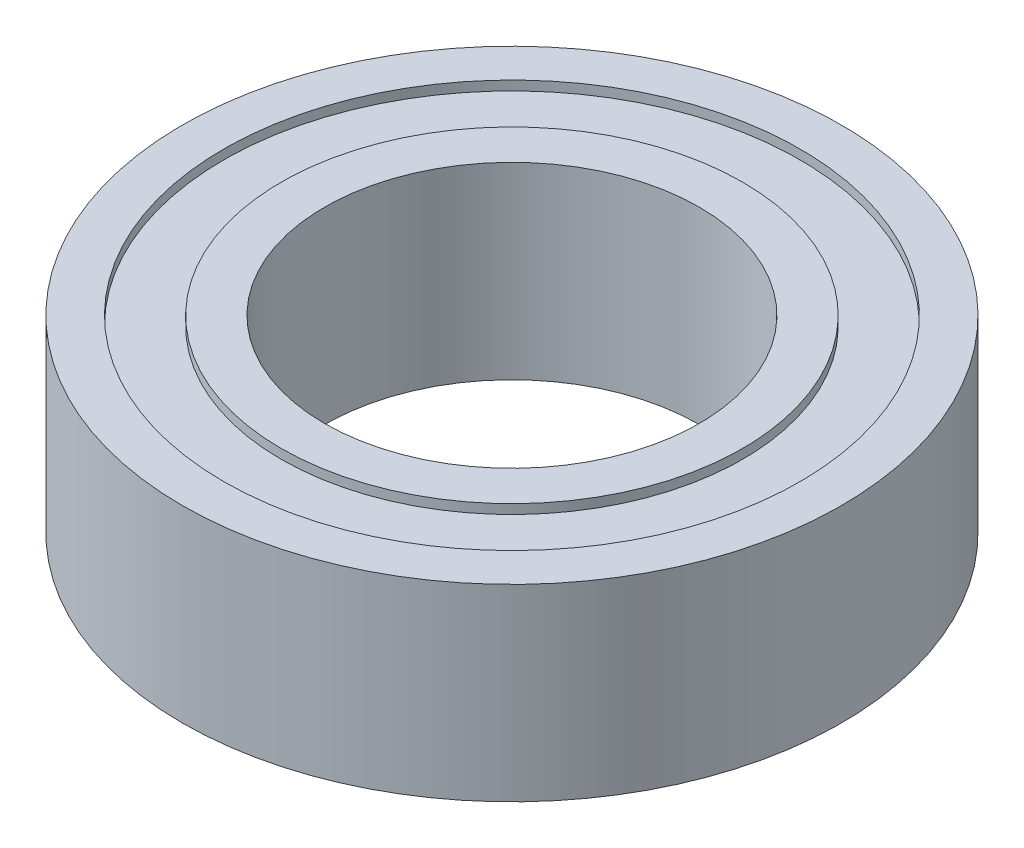
ISO-10303-21;
HEADER;
FILE_DESCRIPTION(('STEP AP214'),'2;1');
FILE_NAME('part.step','',(''),(''),'','','');
FILE_SCHEMA(('AUTOMOTIVE_DESIGN { 1 0 10303 214 1 1 1 1 }'));
ENDSEC;
DATA;
#1=APPLICATION_CONTEXT('core data for automotive mechanical design processes');
#2=APPLICATION_PROTOCOL_DEFINITION('international standard','automotive_design',2000,#1);
#3=PRODUCT_CONTEXT('',#1,'mechanical');
#4=PRODUCT('Part','Part','',(#3));
#5=PRODUCT_RELATED_PRODUCT_CATEGORY('part','',(#4));
#6=PRODUCT_DEFINITION_FORMATION('','',#4);
#7=PRODUCT_DEFINITION_CONTEXT('part definition',#1,'design');
#8=PRODUCT_DEFINITION('design','',#6,#7);
#9=PRODUCT_DEFINITION_SHAPE('','',#8);
#10=(LENGTH_UNIT() NAMED_UNIT(*) SI_UNIT(.MILLI.,.METRE.));
#11=(NAMED_UNIT(*) PLANE_ANGLE_UNIT() SI_UNIT($,.RADIAN.));
#12=(NAMED_UNIT(*) SI_UNIT($,.STERADIAN.) SOLID_ANGLE_UNIT());
#13=UNCERTAINTY_MEASURE_WITH_UNIT(LENGTH_MEASURE(1.E-05),#10,'distance_accuracy_value','');
#14=(GEOMETRIC_REPRESENTATION_CONTEXT(3) GLOBAL_UNCERTAINTY_ASSIGNED_CONTEXT((#13)) GLOBAL_UNIT_ASSIGNED_CONTEXT((#10,
#11,#12)) REPRESENTATION_CONTEXT('',''));
#15=CARTESIAN_POINT('',(0.,0.,0.));
#16=DIRECTION('',(0.,0.,1.));
#17=DIRECTION('',(1.,0.,0.));
#18=AXIS2_PLACEMENT_3D('',#15,#16,#17);
#19=CARTESIAN_POINT('',(0.,-2.,0.));
#20=DIRECTION('',(0.,1.,0.));
#21=DIRECTION('',(0.,0.,1.));
#22=AXIS2_PLACEMENT_3D('',#19,#20,#21);
#23=PLANE('',#22);
#24=CARTESIAN_POINT('',(0.,-2.,0.));
#25=DIRECTION('',(0.,1.,0.));
#26=DIRECTION('',(0.,0.,1.));
#27=AXIS2_PLACEMENT_3D('',#24,#25,#26);
#28=CIRCLE('',#27,3.98);
#29=CARTESIAN_POINT('',(0.,-2.,3.98));
#30=VERTEX_POINT('',#29);
#31=EDGE_CURVE('E57',#30,#30,#28,.T.);
#32=ORIENTED_EDGE('',*,*,#31,.T.);
#33=EDGE_LOOP('',(#32));
#34=FACE_BOUND('',#33,.T.);
#35=CARTESIAN_POINT('',(0.,-2.,0.));
#36=DIRECTION('',(0.,1.,0.));
#37=DIRECTION('',(0.,0.,1.));
#38=AXIS2_PLACEMENT_3D('',#35,#36,#37);
#39=CIRCLE('',#38,4.9);
#40=CARTESIAN_POINT('',(0.,-2.,4.9));
#41=VERTEX_POINT('',#40);
#42=EDGE_CURVE('E44',#41,#41,#39,.T.);
#43=ORIENTED_EDGE('',*,*,#42,.F.);
#44=EDGE_LOOP('',(#43));
#45=FACE_BOUND('',#44,.T.);
#46=ADVANCED_FACE('F33',(#34,#45),#23,.F.);
#47=CARTESIAN_POINT('',(0.,-1.8,0.));
#48=DIRECTION('',(0.,-1.,0.));
#49=DIRECTION('',(0.,0.,1.));
#50=AXIS2_PLACEMENT_3D('',#47,#48,#49);
#51=CYLINDRICAL_SURFACE('',#50,6.12);
#52=CARTESIAN_POINT('',(0.,-1.8,0.));
#53=DIRECTION('',(0.,1.,0.));
#54=DIRECTION('',(0.,0.,1.));
#55=AXIS2_PLACEMENT_3D('',#52,#53,#54);
#56=CIRCLE('',#55,6.12);
#57=CARTESIAN_POINT('',(0.,-1.8,6.12));
#58=VERTEX_POINT('',#57);
#59=EDGE_CURVE('E40',#58,#58,#56,.T.);
#60=ORIENTED_EDGE('',*,*,#59,.T.);
#61=EDGE_LOOP('',(#60));
#62=FACE_BOUND('',#61,.T.);
#63=CARTESIAN_POINT('',(0.,-2.,0.));
#64=DIRECTION('',(0.,1.,0.));
#65=DIRECTION('',(0.,0.,1.));
#66=AXIS2_PLACEMENT_3D('',#63,#64,#65);
#67=CIRCLE('',#66,6.12);
#68=CARTESIAN_POINT('',(0.,-2.,6.12));
#69=VERTEX_POINT('',#68);
#70=EDGE_CURVE('E10',#69,#69,#67,.T.);
#71=ORIENTED_EDGE('',*,*,#70,.F.);
#72=EDGE_LOOP('',(#71));
#73=FACE_BOUND('',#72,.T.);
#74=ADVANCED_FACE('F35',(#62,#73),#51,.F.);
#75=CARTESIAN_POINT('',(0.,-1.8,0.));
#76=DIRECTION('',(0.,-1.,0.));
#77=DIRECTION('',(0.,0.,1.));
#78=AXIS2_PLACEMENT_3D('',#75,#76,#77);
#79=PLANE('',#78);
#80=CARTESIAN_POINT('',(0.,-1.8,0.));
#81=DIRECTION('',(0.,1.,0.));
#82=DIRECTION('',(0.,0.,1.));
#83=AXIS2_PLACEMENT_3D('',#80,#81,#82);
#84=CIRCLE('',#83,4.9);
#85=CARTESIAN_POINT('',(0.,-1.8,4.9));
#86=VERTEX_POINT('',#85);
#87=EDGE_CURVE('E48',#86,#86,#84,.T.);
#88=ORIENTED_EDGE('',*,*,#87,.T.);
#89=EDGE_LOOP('',(#88));
#90=FACE_BOUND('',#89,.T.);
#91=ORIENTED_EDGE('',*,*,#59,.F.);
#92=EDGE_LOOP('',(#91));
#93=FACE_BOUND('',#92,.T.);
#94=ADVANCED_FACE('F120',(#90,#93),#79,.T.);
#95=CARTESIAN_POINT('',(0.,-1.8,0.));
#96=DIRECTION('',(0.,-1.,0.));
#97=DIRECTION('',(0.,0.,1.));
#98=AXIS2_PLACEMENT_3D('',#95,#96,#97);
#99=CYLINDRICAL_SURFACE('',#98,4.9);
#100=ORIENTED_EDGE('',*,*,#87,.F.);
#101=EDGE_LOOP('',(#100));
#102=FACE_BOUND('',#101,.T.);
#103=ORIENTED_EDGE('',*,*,#42,.T.);
#104=EDGE_LOOP('',(#103));
#105=FACE_BOUND('',#104,.T.);
#106=ADVANCED_FACE('F125',(#102,#105),#99,.T.);
#107=CARTESIAN_POINT('',(0.,2.,0.));
#108=DIRECTION('',(0.,1.,0.));
#109=DIRECTION('',(0.,0.,1.));
#110=AXIS2_PLACEMENT_3D('',#107,#108,#109);
#111=PLANE('',#110);
#112=CARTESIAN_POINT('',(0.,2.,0.));
#113=DIRECTION('',(0.,1.,0.));
#114=DIRECTION('',(0.,0.,1.));
#115=AXIS2_PLACEMENT_3D('',#112,#113,#114);
#116=CIRCLE('',#115,3.98);
#117=CARTESIAN_POINT('',(0.,2.,3.98));
#118=VERTEX_POINT('',#117);
#119=EDGE_CURVE('E62',#118,#118,#116,.T.);
#120=ORIENTED_EDGE('',*,*,#119,.F.);
#121=EDGE_LOOP('',(#120));
#122=FACE_BOUND('',#121,.T.);
#123=CARTESIAN_POINT('',(0.,2.,0.));
#124=DIRECTION('',(0.,1.,0.));
#125=DIRECTION('',(0.,0.,1.));
#126=AXIS2_PLACEMENT_3D('',#123,#124,#125);
#127=CIRCLE('',#126,4.9);
#128=CARTESIAN_POINT('',(0.,2.,4.9));
#129=VERTEX_POINT('',#128);
#130=EDGE_CURVE('E72',#129,#129,#127,.T.);
#131=ORIENTED_EDGE('',*,*,#130,.T.);
#132=EDGE_LOOP('',(#131));
#133=FACE_BOUND('',#132,.T.);
#134=ADVANCED_FACE('F100',(#122,#133),#111,.T.);
#135=CARTESIAN_POINT('',(0.,2.,0.));
#136=DIRECTION('',(0.,-1.,0.));
#137=DIRECTION('',(0.,0.,-1.));
#138=AXIS2_PLACEMENT_3D('',#135,#136,#137);
#139=CYLINDRICAL_SURFACE('',#138,7.);
#140=CARTESIAN_POINT('',(0.,2.,0.));
#141=DIRECTION('',(0.,1.,0.));
#142=DIRECTION('',(0.,0.,1.));
#143=AXIS2_PLACEMENT_3D('',#140,#141,#142);
#144=CIRCLE('',#143,7.);
#145=CARTESIAN_POINT('',(0.,2.,7.));
#146=VERTEX_POINT('',#145);
#147=EDGE_CURVE('E53',#146,#146,#144,.T.);
#148=ORIENTED_EDGE('',*,*,#147,.F.);
#149=EDGE_LOOP('',(#148));
#150=FACE_BOUND('',#149,.T.);
#151=CARTESIAN_POINT('',(0.,-2.,0.));
#152=DIRECTION('',(0.,1.,0.));
#153=DIRECTION('',(0.,0.,1.));
#154=AXIS2_PLACEMENT_3D('',#151,#152,#153);
#155=CIRCLE('',#154,7.);
#156=CARTESIAN_POINT('',(0.,-2.,7.));
#157=VERTEX_POINT('',#156);
#158=EDGE_CURVE('E54',#157,#157,#155,.T.);
#159=ORIENTED_EDGE('',*,*,#158,.T.);
#160=EDGE_LOOP('',(#159));
#161=FACE_BOUND('',#160,.T.);
#162=ADVANCED_FACE('F98',(#150,#161),#139,.T.);
#163=CARTESIAN_POINT('',(0.,2.,0.));
#164=DIRECTION('',(0.,1.,0.));
#165=DIRECTION('',(0.,0.,1.));
#166=AXIS2_PLACEMENT_3D('',#163,#164,#165);
#167=CIRCLE('',#166,6.12);
#168=CARTESIAN_POINT('',(0.,2.,6.12));
#169=VERTEX_POINT('',#168);
#170=EDGE_CURVE('E66',#169,#169,#167,.T.);
#171=ORIENTED_EDGE('',*,*,#170,.F.);
#172=EDGE_LOOP('',(#171));
#173=FACE_BOUND('',#172,.T.);
#174=ORIENTED_EDGE('',*,*,#147,.T.);
#175=EDGE_LOOP('',(#174));
#176=FACE_BOUND('',#175,.T.);
#177=ADVANCED_FACE('F94',(#173,#176),#111,.T.);
#178=ORIENTED_EDGE('',*,*,#70,.T.);
#179=EDGE_LOOP('',(#178));
#180=FACE_BOUND('',#179,.T.);
#181=ORIENTED_EDGE('',*,*,#158,.F.);
#182=EDGE_LOOP('',(#181));
#183=FACE_BOUND('',#182,.T.);
#184=ADVANCED_FACE('F97',(#180,#183),#23,.F.);
#185=CARTESIAN_POINT('',(0.,-2.,0.));
#186=DIRECTION('',(0.,1.,0.));
#187=DIRECTION('',(0.,0.,1.));
#188=AXIS2_PLACEMENT_3D('',#185,#186,#187);
#189=CYLINDRICAL_SURFACE('',#188,3.98);
#190=ORIENTED_EDGE('',*,*,#31,.F.);
#191=EDGE_LOOP('',(#190));
#192=FACE_BOUND('',#191,.T.);
#193=ORIENTED_EDGE('',*,*,#119,.T.);
#194=EDGE_LOOP('',(#193));
#195=FACE_BOUND('',#194,.T.);
#196=ADVANCED_FACE('F90',(#192,#195),#189,.F.);
#197=CARTESIAN_POINT('',(0.,1.8,0.));
#198=DIRECTION('',(0.,1.,0.));
#199=DIRECTION('',(0.,0.,1.));
#200=AXIS2_PLACEMENT_3D('',#197,#198,#199);
#201=CYLINDRICAL_SURFACE('',#200,6.12);
#202=CARTESIAN_POINT('',(0.,1.8,0.));
#203=DIRECTION('',(0.,1.,0.));
#204=DIRECTION('',(0.,0.,1.));
#205=AXIS2_PLACEMENT_3D('',#202,#203,#204);
#206=CIRCLE('',#205,6.12);
#207=CARTESIAN_POINT('',(0.,1.8,6.12));
#208=VERTEX_POINT('',#207);
#209=EDGE_CURVE('E65',#208,#208,#206,.T.);
#210=ORIENTED_EDGE('',*,*,#209,.F.);
#211=EDGE_LOOP('',(#210));
#212=FACE_BOUND('',#211,.T.);
#213=ORIENTED_EDGE('',*,*,#170,.T.);
#214=EDGE_LOOP('',(#213));
#215=FACE_BOUND('',#214,.T.);
#216=ADVANCED_FACE('F84',(#212,#215),#201,.F.);
#217=CARTESIAN_POINT('',(0.,1.8,0.));
#218=DIRECTION('',(0.,1.,0.));
#219=DIRECTION('',(0.,0.,1.));
#220=AXIS2_PLACEMENT_3D('',#217,#218,#219);
#221=PLANE('',#220);
#222=CARTESIAN_POINT('',(0.,1.8,0.));
#223=DIRECTION('',(0.,1.,0.));
#224=DIRECTION('',(0.,0.,1.));
#225=AXIS2_PLACEMENT_3D('',#222,#223,#224);
#226=CIRCLE('',#225,4.9);
#227=CARTESIAN_POINT('',(0.,1.8,4.9));
#228=VERTEX_POINT('',#227);
#229=EDGE_CURVE('E69',#228,#228,#226,.T.);
#230=ORIENTED_EDGE('',*,*,#229,.F.);
#231=EDGE_LOOP('',(#230));
#232=FACE_BOUND('',#231,.T.);
#233=ORIENTED_EDGE('',*,*,#209,.T.);
#234=EDGE_LOOP('',(#233));
#235=FACE_BOUND('',#234,.T.);
#236=ADVANCED_FACE('F81',(#232,#235),#221,.T.);
#237=CARTESIAN_POINT('',(0.,1.8,0.));
#238=DIRECTION('',(0.,1.,0.));
#239=DIRECTION('',(0.,0.,1.));
#240=AXIS2_PLACEMENT_3D('',#237,#238,#239);
#241=CYLINDRICAL_SURFACE('',#240,4.9);
#242=ORIENTED_EDGE('',*,*,#229,.T.);
#243=EDGE_LOOP('',(#242));
#244=FACE_BOUND('',#243,.T.);
#245=ORIENTED_EDGE('',*,*,#130,.F.);
#246=EDGE_LOOP('',(#245));
#247=FACE_BOUND('',#246,.T.);
#248=ADVANCED_FACE('F78',(#244,#247),#241,.T.);
#249=CLOSED_SHELL('',(#46,#74,#94,#106,#134,#162,#177,#184,#196,#216,#236,#248));
#250=MANIFOLD_SOLID_BREP('B2',#249);
#251=ADVANCED_BREP_SHAPE_REPRESENTATION('',(#18,#250),#14);
#252=SHAPE_DEFINITION_REPRESENTATION(#9,#251);
ENDSEC;
END-ISO-10303-21;
